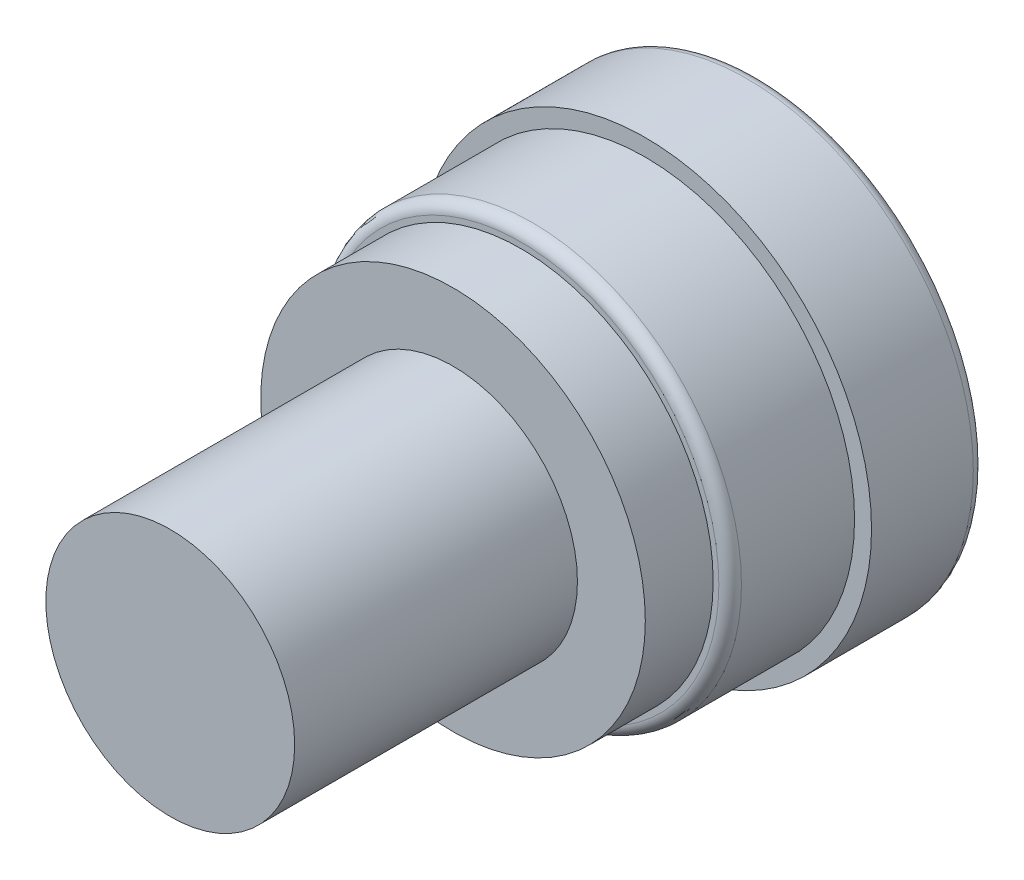
ISO-10303-21;
HEADER;
FILE_DESCRIPTION(('STEP AP214'),'2;1');
FILE_NAME('part.step','',(''),(''),'','','');
FILE_SCHEMA(('AUTOMOTIVE_DESIGN { 1 0 10303 214 1 1 1 1 }'));
ENDSEC;
DATA;
#1=APPLICATION_CONTEXT('core data for automotive mechanical design processes');
#2=APPLICATION_PROTOCOL_DEFINITION('international standard','automotive_design',2000,#1);
#3=PRODUCT_CONTEXT('',#1,'mechanical');
#4=PRODUCT('Part','Part','',(#3));
#5=PRODUCT_RELATED_PRODUCT_CATEGORY('part','',(#4));
#6=PRODUCT_DEFINITION_FORMATION('','',#4);
#7=PRODUCT_DEFINITION_CONTEXT('part definition',#1,'design');
#8=PRODUCT_DEFINITION('design','',#6,#7);
#9=PRODUCT_DEFINITION_SHAPE('','',#8);
#10=(LENGTH_UNIT() NAMED_UNIT(*) SI_UNIT(.MILLI.,.METRE.));
#11=(NAMED_UNIT(*) PLANE_ANGLE_UNIT() SI_UNIT($,.RADIAN.));
#12=(NAMED_UNIT(*) SI_UNIT($,.STERADIAN.) SOLID_ANGLE_UNIT());
#13=UNCERTAINTY_MEASURE_WITH_UNIT(LENGTH_MEASURE(1.E-05),#10,'distance_accuracy_value','');
#14=(GEOMETRIC_REPRESENTATION_CONTEXT(3) GLOBAL_UNCERTAINTY_ASSIGNED_CONTEXT((#13)) GLOBAL_UNIT_ASSIGNED_CONTEXT((#10,
#11,#12)) REPRESENTATION_CONTEXT('',''));
#15=CARTESIAN_POINT('',(0.,0.,0.));
#16=DIRECTION('',(0.,0.,1.));
#17=DIRECTION('',(1.,0.,0.));
#18=AXIS2_PLACEMENT_3D('',#15,#16,#17);
#19=CARTESIAN_POINT('',(0.,0.,10.));
#20=DIRECTION('',(0.,0.,-1.));
#21=DIRECTION('',(-1.,0.,0.));
#22=AXIS2_PLACEMENT_3D('',#19,#20,#21);
#23=CYLINDRICAL_SURFACE('',#22,20.);
#24=CARTESIAN_POINT('',(0.,0.,0.999999999999999));
#25=DIRECTION('',(0.,0.,1.));
#26=DIRECTION('',(1.,0.,0.));
#27=AXIS2_PLACEMENT_3D('',#24,#25,#26);
#28=CIRCLE('',#27,20.);
#29=CARTESIAN_POINT('',(20.,0.,0.999999999999999));
#30=VERTEX_POINT('',#29);
#31=EDGE_CURVE('E38',#30,#30,#28,.T.);
#32=ORIENTED_EDGE('',*,*,#31,.T.);
#33=EDGE_LOOP('',(#32));
#34=FACE_BOUND('',#33,.T.);
#35=CARTESIAN_POINT('',(0.,0.,10.));
#36=DIRECTION('',(0.,0.,1.));
#37=DIRECTION('',(1.,0.,0.));
#38=AXIS2_PLACEMENT_3D('',#35,#36,#37);
#39=CIRCLE('',#38,20.);
#40=CARTESIAN_POINT('',(20.,0.,10.));
#41=VERTEX_POINT('',#40);
#42=EDGE_CURVE('E52',#41,#41,#39,.T.);
#43=ORIENTED_EDGE('',*,*,#42,.F.);
#44=EDGE_LOOP('',(#43));
#45=FACE_BOUND('',#44,.T.);
#46=ADVANCED_FACE('F31',(#34,#45),#23,.T.);
#47=CARTESIAN_POINT('',(0.,0.,10.));
#48=DIRECTION('',(0.,0.,1.));
#49=DIRECTION('',(1.,0.,0.));
#50=AXIS2_PLACEMENT_3D('',#47,#48,#49);
#51=PLANE('',#50);
#52=CARTESIAN_POINT('',(0.,0.,10.));
#53=DIRECTION('',(0.,0.,1.));
#54=DIRECTION('',(1.,0.,0.));
#55=AXIS2_PLACEMENT_3D('',#52,#53,#54);
#56=CIRCLE('',#55,18.5);
#57=CARTESIAN_POINT('',(18.5,0.,10.));
#58=VERTEX_POINT('',#57);
#59=EDGE_CURVE('E55',#58,#58,#56,.T.);
#60=ORIENTED_EDGE('',*,*,#59,.F.);
#61=EDGE_LOOP('',(#60));
#62=FACE_BOUND('',#61,.T.);
#63=ORIENTED_EDGE('',*,*,#42,.T.);
#64=EDGE_LOOP('',(#63));
#65=FACE_BOUND('',#64,.T.);
#66=ADVANCED_FACE('F102',(#62,#65),#51,.T.);
#67=CARTESIAN_POINT('',(0.,0.,0.));
#68=DIRECTION('',(0.,0.,1.));
#69=DIRECTION('',(1.,0.,0.));
#70=AXIS2_PLACEMENT_3D('',#67,#68,#69);
#71=PLANE('',#70);
#72=CARTESIAN_POINT('',(0.,0.,0.));
#73=DIRECTION('',(0.,0.,1.));
#74=DIRECTION('',(1.,0.,0.));
#75=AXIS2_PLACEMENT_3D('',#72,#73,#74);
#76=CIRCLE('',#75,19.);
#77=CARTESIAN_POINT('',(19.,0.,0.));
#78=VERTEX_POINT('',#77);
#79=EDGE_CURVE('E10',#78,#78,#76,.F.);
#80=ORIENTED_EDGE('',*,*,#79,.T.);
#81=EDGE_LOOP('',(#80));
#82=FACE_BOUND('',#81,.T.);
#83=ADVANCED_FACE('F98',(#82),#71,.F.);
#84=CARTESIAN_POINT('',(0.,0.,21.));
#85=DIRECTION('',(0.,0.,-1.));
#86=DIRECTION('',(-1.,0.,0.));
#87=AXIS2_PLACEMENT_3D('',#84,#85,#86);
#88=CYLINDRICAL_SURFACE('',#87,18.5);
#89=CARTESIAN_POINT('',(0.,0.,20.));
#90=DIRECTION('',(0.,0.,1.));
#91=DIRECTION('',(1.,0.,0.));
#92=AXIS2_PLACEMENT_3D('',#89,#90,#91);
#93=CIRCLE('',#92,18.5);
#94=CARTESIAN_POINT('',(18.5,0.,20.));
#95=VERTEX_POINT('',#94);
#96=EDGE_CURVE('E42',#95,#95,#93,.F.);
#97=ORIENTED_EDGE('',*,*,#96,.T.);
#98=EDGE_LOOP('',(#97));
#99=FACE_BOUND('',#98,.T.);
#100=ORIENTED_EDGE('',*,*,#59,.T.);
#101=EDGE_LOOP('',(#100));
#102=FACE_BOUND('',#101,.T.);
#103=ADVANCED_FACE('F92',(#99,#102),#88,.T.);
#104=CARTESIAN_POINT('',(0.,0.,21.));
#105=DIRECTION('',(0.,0.,1.));
#106=DIRECTION('',(1.,0.,0.));
#107=AXIS2_PLACEMENT_3D('',#104,#105,#106);
#108=PLANE('',#107);
#109=CARTESIAN_POINT('',(0.,0.,21.));
#110=DIRECTION('',(0.,0.,1.));
#111=DIRECTION('',(1.,0.,0.));
#112=AXIS2_PLACEMENT_3D('',#109,#110,#111);
#113=CIRCLE('',#112,17.5);
#114=CARTESIAN_POINT('',(17.5,0.,21.));
#115=VERTEX_POINT('',#114);
#116=EDGE_CURVE('E46',#115,#115,#113,.T.);
#117=ORIENTED_EDGE('',*,*,#116,.T.);
#118=EDGE_LOOP('',(#117));
#119=FACE_BOUND('',#118,.T.);
#120=CARTESIAN_POINT('',(0.,0.,21.));
#121=DIRECTION('',(0.,0.,1.));
#122=DIRECTION('',(1.,0.,0.));
#123=AXIS2_PLACEMENT_3D('',#120,#121,#122);
#124=CIRCLE('',#123,17.);
#125=CARTESIAN_POINT('',(17.,0.,21.));
#126=VERTEX_POINT('',#125);
#127=EDGE_CURVE('E59',#126,#126,#124,.T.);
#128=ORIENTED_EDGE('',*,*,#127,.F.);
#129=EDGE_LOOP('',(#128));
#130=FACE_BOUND('',#129,.T.);
#131=ADVANCED_FACE('F87',(#119,#130),#108,.T.);
#132=CARTESIAN_POINT('',(0.,0.,27.));
#133=DIRECTION('',(0.,0.,-1.));
#134=DIRECTION('',(-1.,0.,0.));
#135=AXIS2_PLACEMENT_3D('',#132,#133,#134);
#136=CYLINDRICAL_SURFACE('',#135,17.);
#137=CARTESIAN_POINT('',(0.,0.,27.));
#138=DIRECTION('',(0.,0.,1.));
#139=DIRECTION('',(1.,0.,0.));
#140=AXIS2_PLACEMENT_3D('',#137,#138,#139);
#141=CIRCLE('',#140,17.);
#142=CARTESIAN_POINT('',(17.,0.,27.));
#143=VERTEX_POINT('',#142);
#144=EDGE_CURVE('E56',#143,#143,#141,.T.);
#145=ORIENTED_EDGE('',*,*,#144,.F.);
#146=EDGE_LOOP('',(#145));
#147=FACE_BOUND('',#146,.T.);
#148=ORIENTED_EDGE('',*,*,#127,.T.);
#149=EDGE_LOOP('',(#148));
#150=FACE_BOUND('',#149,.T.);
#151=ADVANCED_FACE('F81',(#147,#150),#136,.T.);
#152=CARTESIAN_POINT('',(0.,0.,27.));
#153=DIRECTION('',(0.,0.,1.));
#154=DIRECTION('',(1.,0.,0.));
#155=AXIS2_PLACEMENT_3D('',#152,#153,#154);
#156=PLANE('',#155);
#157=CARTESIAN_POINT('',(0.,0.,27.));
#158=DIRECTION('',(0.,0.,1.));
#159=DIRECTION('',(1.,0.,0.));
#160=AXIS2_PLACEMENT_3D('',#157,#158,#159);
#161=CIRCLE('',#160,11.);
#162=CARTESIAN_POINT('',(11.,0.,27.));
#163=VERTEX_POINT('',#162);
#164=EDGE_CURVE('E51',#163,#163,#161,.T.);
#165=ORIENTED_EDGE('',*,*,#164,.F.);
#166=EDGE_LOOP('',(#165));
#167=FACE_BOUND('',#166,.T.);
#168=ORIENTED_EDGE('',*,*,#144,.T.);
#169=EDGE_LOOP('',(#168));
#170=FACE_BOUND('',#169,.T.);
#171=ADVANCED_FACE('F75',(#167,#170),#156,.T.);
#172=CARTESIAN_POINT('',(0.,0.,52.));
#173=DIRECTION('',(0.,0.,-1.));
#174=DIRECTION('',(-1.,0.,0.));
#175=AXIS2_PLACEMENT_3D('',#172,#173,#174);
#176=CYLINDRICAL_SURFACE('',#175,11.);
#177=CARTESIAN_POINT('',(0.,0.,52.));
#178=DIRECTION('',(0.,0.,1.));
#179=DIRECTION('',(1.,0.,0.));
#180=AXIS2_PLACEMENT_3D('',#177,#178,#179);
#181=CIRCLE('',#180,11.);
#182=CARTESIAN_POINT('',(11.,0.,52.));
#183=VERTEX_POINT('',#182);
#184=EDGE_CURVE('E64',#183,#183,#181,.T.);
#185=ORIENTED_EDGE('',*,*,#184,.F.);
#186=EDGE_LOOP('',(#185));
#187=FACE_BOUND('',#186,.T.);
#188=ORIENTED_EDGE('',*,*,#164,.T.);
#189=EDGE_LOOP('',(#188));
#190=FACE_BOUND('',#189,.T.);
#191=ADVANCED_FACE('F72',(#187,#190),#176,.T.);
#192=CARTESIAN_POINT('',(0.,0.,52.));
#193=DIRECTION('',(0.,0.,1.));
#194=DIRECTION('',(1.,0.,0.));
#195=AXIS2_PLACEMENT_3D('',#192,#193,#194);
#196=PLANE('',#195);
#197=ORIENTED_EDGE('',*,*,#184,.T.);
#198=EDGE_LOOP('',(#197));
#199=FACE_BOUND('',#198,.T.);
#200=ADVANCED_FACE('F70',(#199),#196,.T.);
#201=CARTESIAN_POINT('',(0.,0.,20.));
#202=DIRECTION('',(0.,0.,1.));
#203=DIRECTION('',(1.,0.,0.));
#204=AXIS2_PLACEMENT_3D('',#201,#202,#203);
#205=TOROIDAL_SURFACE('',#204,17.5,1.);
#206=ORIENTED_EDGE('',*,*,#96,.F.);
#207=EDGE_LOOP('',(#206));
#208=FACE_BOUND('',#207,.T.);
#209=ORIENTED_EDGE('',*,*,#116,.F.);
#210=EDGE_LOOP('',(#209));
#211=FACE_BOUND('',#210,.T.);
#212=ADVANCED_FACE('F111',(#208,#211),#205,.T.);
#213=CARTESIAN_POINT('',(0.,0.,0.999999999999999));
#214=DIRECTION('',(0.,0.,1.));
#215=DIRECTION('',(1.,0.,0.));
#216=AXIS2_PLACEMENT_3D('',#213,#214,#215);
#217=TOROIDAL_SURFACE('',#216,19.,1.);
#218=ORIENTED_EDGE('',*,*,#79,.F.);
#219=EDGE_LOOP('',(#218));
#220=FACE_BOUND('',#219,.T.);
#221=ORIENTED_EDGE('',*,*,#31,.F.);
#222=EDGE_LOOP('',(#221));
#223=FACE_BOUND('',#222,.T.);
#224=ADVANCED_FACE('F33',(#220,#223),#217,.T.);
#225=CLOSED_SHELL('',(#46,#66,#83,#103,#131,#151,#171,#191,#200,#212,#224));
#226=MANIFOLD_SOLID_BREP('B2',#225);
#227=ADVANCED_BREP_SHAPE_REPRESENTATION('',(#18,#226),#14);
#228=SHAPE_DEFINITION_REPRESENTATION(#9,#227);
ENDSEC;
END-ISO-10303-21;
